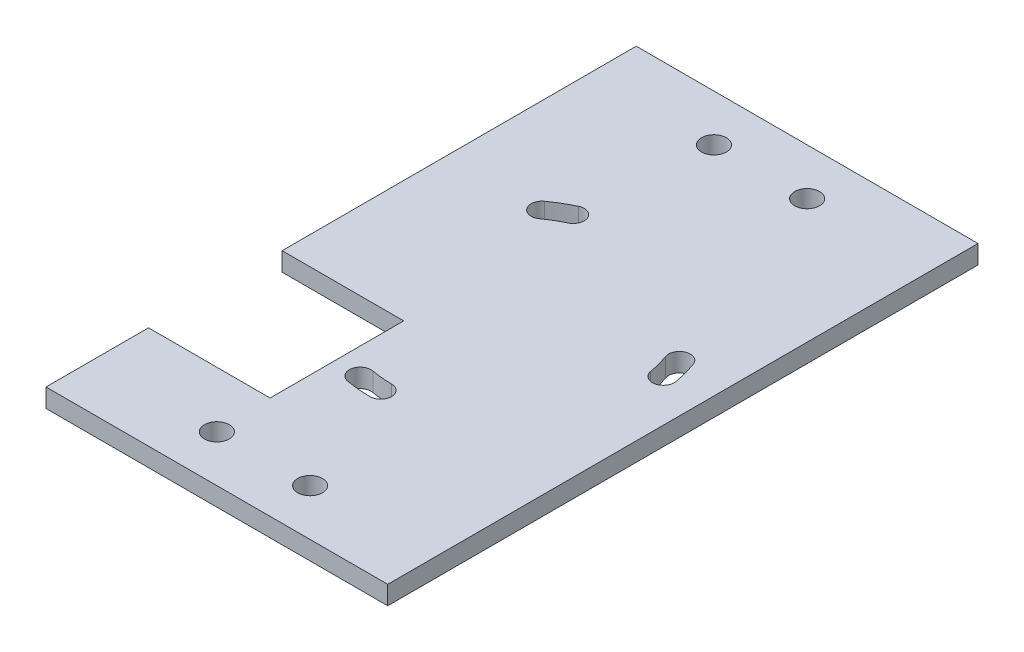
ISO-10303-21;
HEADER;
FILE_DESCRIPTION(('STEP AP214'),'2;1');
FILE_NAME('part.step','',(''),(''),'','','');
FILE_SCHEMA(('AUTOMOTIVE_DESIGN { 1 0 10303 214 1 1 1 1 }'));
ENDSEC;
DATA;
#1=APPLICATION_CONTEXT('core data for automotive mechanical design processes');
#2=APPLICATION_PROTOCOL_DEFINITION('international standard','automotive_design',2000,#1);
#3=PRODUCT_CONTEXT('',#1,'mechanical');
#4=PRODUCT('Part','Part','',(#3));
#5=PRODUCT_RELATED_PRODUCT_CATEGORY('part','',(#4));
#6=PRODUCT_DEFINITION_FORMATION('','',#4);
#7=PRODUCT_DEFINITION_CONTEXT('part definition',#1,'design');
#8=PRODUCT_DEFINITION('design','',#6,#7);
#9=PRODUCT_DEFINITION_SHAPE('','',#8);
#10=(LENGTH_UNIT() NAMED_UNIT(*) SI_UNIT(.MILLI.,.METRE.));
#11=(NAMED_UNIT(*) PLANE_ANGLE_UNIT() SI_UNIT($,.RADIAN.));
#12=(NAMED_UNIT(*) SI_UNIT($,.STERADIAN.) SOLID_ANGLE_UNIT());
#13=UNCERTAINTY_MEASURE_WITH_UNIT(LENGTH_MEASURE(1.E-05),#10,'distance_accuracy_value','');
#14=(GEOMETRIC_REPRESENTATION_CONTEXT(3) GLOBAL_UNCERTAINTY_ASSIGNED_CONTEXT((#13)) GLOBAL_UNIT_ASSIGNED_CONTEXT((#10,
#11,#12)) REPRESENTATION_CONTEXT('',''));
#15=CARTESIAN_POINT('',(0.,0.,0.));
#16=DIRECTION('',(0.,0.,1.));
#17=DIRECTION('',(1.,0.,0.));
#18=AXIS2_PLACEMENT_3D('',#15,#16,#17);
#19=CARTESIAN_POINT('',(54.9999999999997,163.5,285.));
#20=DIRECTION('',(0.,1.,0.));
#21=DIRECTION('',(0.,0.,1.));
#22=AXIS2_PLACEMENT_3D('',#19,#20,#21);
#23=PLANE('',#22);
#24=CARTESIAN_POINT('',(-14.9999999999996,163.5,270.));
#25=DIRECTION('',(0.,1.,0.));
#26=DIRECTION('',(0.,0.,1.));
#27=AXIS2_PLACEMENT_3D('',#24,#25,#26);
#28=CIRCLE('',#27,4.);
#29=CARTESIAN_POINT('',(-14.9999999999996,163.5,274.));
#30=VERTEX_POINT('',#29);
#31=EDGE_CURVE('E337',#30,#30,#28,.F.);
#32=ORIENTED_EDGE('',*,*,#31,.F.);
#33=EDGE_LOOP('',(#32));
#34=FACE_BOUND('',#33,.T.);
#35=CARTESIAN_POINT('',(14.9999999999996,163.5,270.));
#36=DIRECTION('',(0.,1.,0.));
#37=DIRECTION('',(0.,0.,1.));
#38=AXIS2_PLACEMENT_3D('',#35,#36,#37);
#39=CIRCLE('',#38,4.);
#40=CARTESIAN_POINT('',(14.9999999999996,163.5,274.));
#41=VERTEX_POINT('',#40);
#42=EDGE_CURVE('E343',#41,#41,#39,.F.);
#43=ORIENTED_EDGE('',*,*,#42,.F.);
#44=EDGE_LOOP('',(#43));
#45=FACE_BOUND('',#44,.T.);
#46=CARTESIAN_POINT('',(15.0000000000004,163.5,110.));
#47=DIRECTION('',(0.,1.,0.));
#48=DIRECTION('',(0.,0.,1.));
#49=AXIS2_PLACEMENT_3D('',#46,#47,#48);
#50=CIRCLE('',#49,4.);
#51=CARTESIAN_POINT('',(15.0000000000004,163.5,114.));
#52=VERTEX_POINT('',#51);
#53=EDGE_CURVE('E346',#52,#52,#50,.F.);
#54=ORIENTED_EDGE('',*,*,#53,.F.);
#55=EDGE_LOOP('',(#54));
#56=FACE_BOUND('',#55,.T.);
#57=CARTESIAN_POINT('',(-15.0000000000004,163.5,110.));
#58=DIRECTION('',(0.,1.,0.));
#59=DIRECTION('',(0.,0.,1.));
#60=AXIS2_PLACEMENT_3D('',#57,#58,#59);
#61=CIRCLE('',#60,4.);
#62=CARTESIAN_POINT('',(-15.0000000000004,163.5,114.));
#63=VERTEX_POINT('',#62);
#64=EDGE_CURVE('E349',#63,#63,#61,.F.);
#65=ORIENTED_EDGE('',*,*,#64,.F.);
#66=EDGE_LOOP('',(#65));
#67=FACE_BOUND('',#66,.T.);
#68=CARTESIAN_POINT('',(-7.49679931350594,163.5,231.373647797338));
#69=DIRECTION('',(0.,1.,0.));
#70=DIRECTION('',(0.,0.,1.));
#71=AXIS2_PLACEMENT_3D('',#68,#69,#70);
#72=CIRCLE('',#71,3.49999999999998);
#73=CARTESIAN_POINT('',(-8.12082887800866,163.5,234.817568107482));
#74=VERTEX_POINT('',#73);
#75=CARTESIAN_POINT('',(-6.87276974900324,163.5,227.929727487193));
#76=VERTEX_POINT('',#75);
#77=EDGE_CURVE('E253',#74,#76,#72,.F.);
#78=ORIENTED_EDGE('',*,*,#77,.F.);
#79=CARTESIAN_POINT('',(0.,163.5,190.));
#80=DIRECTION('',(0.,1.,0.));
#81=DIRECTION('',(0.,0.,1.));
#82=AXIS2_PLACEMENT_3D('',#79,#80,#81);
#83=CIRCLE('',#82,45.5473629613692);
#84=CARTESIAN_POINT('',(-0.214966210620846,163.5,235.546855679212));
#85=VERTEX_POINT('',#84);
#86=EDGE_CURVE('E261',#85,#74,#83,.F.);
#87=ORIENTED_EDGE('',*,*,#86,.F.);
#88=CARTESIAN_POINT('',(-0.198447543276456,163.5,232.04689466034));
#89=DIRECTION('',(0.,1.,0.));
#90=DIRECTION('',(0.,0.,1.));
#91=AXIS2_PLACEMENT_3D('',#88,#89,#90);
#92=CIRCLE('',#91,3.49999999999998);
#93=CARTESIAN_POINT('',(-0.181928875932069,163.5,228.546933641467));
#94=VERTEX_POINT('',#93);
#95=EDGE_CURVE('E258',#94,#85,#92,.F.);
#96=ORIENTED_EDGE('',*,*,#95,.F.);
#97=CARTESIAN_POINT('',(0.,163.5,190.));
#98=DIRECTION('',(0.,1.,0.));
#99=DIRECTION('',(0.,0.,1.));
#100=AXIS2_PLACEMENT_3D('',#97,#98,#99);
#101=CIRCLE('',#100,38.5473629613692);
#102=EDGE_CURVE('E255',#94,#76,#101,.F.);
#103=ORIENTED_EDGE('',*,*,#102,.T.);
#104=EDGE_LOOP('',(#78,#87,#96,#103));
#105=FACE_BOUND('',#104,.T.);
#106=CARTESIAN_POINT('',(41.4085690380747,163.5,182.698552046058));
#107=DIRECTION('',(0.,1.,0.));
#108=DIRECTION('',(0.,0.,1.));
#109=AXIS2_PLACEMENT_3D('',#106,#107,#108);
#110=CIRCLE('',#109,3.5);
#111=CARTESIAN_POINT('',(44.8553961736175,163.5,182.090783424224));
#112=VERTEX_POINT('',#111);
#113=CARTESIAN_POINT('',(37.961741902532,163.5,183.306320667893));
#114=VERTEX_POINT('',#113);
#115=EDGE_CURVE('E243',#112,#114,#110,.F.);
#116=ORIENTED_EDGE('',*,*,#115,.F.);
#117=CARTESIAN_POINT('',(0.,163.5,190.));
#118=DIRECTION('',(0.,1.,0.));
#119=DIRECTION('',(0.,0.,1.));
#120=AXIS2_PLACEMENT_3D('',#117,#118,#119);
#121=CIRCLE('',#120,45.5473629613692);
#122=CARTESIAN_POINT('',(42.8005208710561,163.5,174.421884391847));
#123=VERTEX_POINT('',#122);
#124=EDGE_CURVE('E246',#123,#112,#121,.F.);
#125=ORIENTED_EDGE('',*,*,#124,.F.);
#126=CARTESIAN_POINT('',(39.5115966983055,163.5,175.618954893486));
#127=DIRECTION('',(0.,1.,0.));
#128=DIRECTION('',(0.,0.,1.));
#129=AXIS2_PLACEMENT_3D('',#126,#127,#128);
#130=CIRCLE('',#129,3.50000000000001);
#131=CARTESIAN_POINT('',(36.2226725255548,163.5,176.816025395126));
#132=VERTEX_POINT('',#131);
#133=EDGE_CURVE('E248',#132,#123,#130,.F.);
#134=ORIENTED_EDGE('',*,*,#133,.F.);
#135=CARTESIAN_POINT('',(0.,163.5,190.));
#136=DIRECTION('',(0.,1.,0.));
#137=DIRECTION('',(0.,0.,1.));
#138=AXIS2_PLACEMENT_3D('',#135,#136,#137);
#139=CIRCLE('',#138,38.5473629613692);
#140=EDGE_CURVE('E250',#132,#114,#139,.F.);
#141=ORIENTED_EDGE('',*,*,#140,.T.);
#142=EDGE_LOOP('',(#116,#125,#134,#141));
#143=FACE_BOUND('',#142,.T.);
#144=CARTESIAN_POINT('',(-24.4983000477613,163.5,155.826705941994));
#145=DIRECTION('',(0.,1.,0.));
#146=DIRECTION('',(0.,0.,1.));
#147=AXIS2_PLACEMENT_3D('',#144,#145,#146);
#148=CIRCLE('',#147,3.50000000000002);
#149=CARTESIAN_POINT('',(-22.4590746569576,163.5,158.671272658649));
#150=VERTEX_POINT('',#149);
#151=CARTESIAN_POINT('',(-26.5375254385651,163.5,152.982139225339));
#152=VERTEX_POINT('',#151);
#153=EDGE_CURVE('E234',#150,#152,#148,.F.);
#154=ORIENTED_EDGE('',*,*,#153,.F.);
#155=CARTESIAN_POINT('',(0.,163.5,190.));
#156=DIRECTION('',(0.,1.,0.));
#157=DIRECTION('',(0.,0.,1.));
#158=AXIS2_PLACEMENT_3D('',#155,#156,#157);
#159=CIRCLE('',#158,38.5473629613692);
#160=CARTESIAN_POINT('',(-16.6776944362023,163.5,155.247249035965));
#161=VERTEX_POINT('',#160);
#162=EDGE_CURVE('E240',#150,#161,#159,.F.);
#163=ORIENTED_EDGE('',*,*,#162,.T.);
#164=CARTESIAN_POINT('',(-18.191985584606,163.5,152.091789906478));
#165=DIRECTION('',(0.,1.,0.));
#166=DIRECTION('',(0.,0.,1.));
#167=AXIS2_PLACEMENT_3D('',#164,#165,#166);
#168=CIRCLE('',#167,3.49999999999999);
#169=CARTESIAN_POINT('',(-19.7062767330098,163.5,148.93633077699));
#170=VERTEX_POINT('',#169);
#171=EDGE_CURVE('E238',#170,#161,#168,.F.);
#172=ORIENTED_EDGE('',*,*,#171,.F.);
#173=CARTESIAN_POINT('',(0.,163.5,190.));
#174=DIRECTION('',(0.,1.,0.));
#175=DIRECTION('',(0.,0.,1.));
#176=AXIS2_PLACEMENT_3D('',#173,#174,#175);
#177=CIRCLE('',#176,45.5473629613692);
#178=EDGE_CURVE('E236',#152,#170,#177,.F.);
#179=ORIENTED_EDGE('',*,*,#178,.F.);
#180=EDGE_LOOP('',(#154,#163,#172,#179));
#181=FACE_BOUND('',#180,.T.);
#182=DIRECTION('',(1.,0.,0.));
#183=VECTOR('',#182,1.);
#184=CARTESIAN_POINT('',(54.9999999999997,163.5,209.));
#185=LINE('',#184,#183);
#186=CARTESIAN_POINT('',(-54.9999999999997,163.5,209.));
#187=VERTEX_POINT('',#186);
#188=CARTESIAN_POINT('',(-15.8623207248155,163.5,209.));
#189=VERTEX_POINT('',#188);
#190=EDGE_CURVE('E330',#187,#189,#185,.T.);
#191=ORIENTED_EDGE('',*,*,#190,.F.);
#192=DIRECTION('',(0.,0.,-1.));
#193=VECTOR('',#192,1.);
#194=CARTESIAN_POINT('',(-55.0000000000003,163.5,285.));
#195=LINE('',#194,#193);
#196=CARTESIAN_POINT('',(-55.0000000000003,163.5,95.0000000000002));
#197=VERTEX_POINT('',#196);
#198=EDGE_CURVE('E195',#187,#197,#195,.T.);
#199=ORIENTED_EDGE('',*,*,#198,.T.);
#200=DIRECTION('',(-1.,0.,0.));
#201=VECTOR('',#200,1.);
#202=CARTESIAN_POINT('',(54.9999999999997,163.5,95.0000000000002));
#203=LINE('',#202,#201);
#204=CARTESIAN_POINT('',(54.9999999999997,163.5,95.0000000000002));
#205=VERTEX_POINT('',#204);
#206=EDGE_CURVE('E47',#205,#197,#203,.T.);
#207=ORIENTED_EDGE('',*,*,#206,.F.);
#208=DIRECTION('',(0.,0.,-1.));
#209=VECTOR('',#208,1.);
#210=CARTESIAN_POINT('',(54.9999999999997,163.5,285.));
#211=LINE('',#210,#209);
#212=CARTESIAN_POINT('',(54.9999999999997,163.5,285.));
#213=VERTEX_POINT('',#212);
#214=EDGE_CURVE('E207',#213,#205,#211,.T.);
#215=ORIENTED_EDGE('',*,*,#214,.F.);
#216=DIRECTION('',(-1.,0.,0.));
#217=VECTOR('',#216,1.);
#218=CARTESIAN_POINT('',(54.9999999999997,163.5,285.));
#219=LINE('',#218,#217);
#220=CARTESIAN_POINT('',(-55.0000000000003,163.5,285.));
#221=VERTEX_POINT('',#220);
#222=EDGE_CURVE('E11',#213,#221,#219,.T.);
#223=ORIENTED_EDGE('',*,*,#222,.T.);
#224=CARTESIAN_POINT('',(-55.0000000000003,163.5,252.));
#225=VERTEX_POINT('',#224);
#226=EDGE_CURVE('E227',#221,#225,#195,.T.);
#227=ORIENTED_EDGE('',*,*,#226,.T.);
#228=DIRECTION('',(-1.,0.,0.));
#229=VECTOR('',#228,1.);
#230=CARTESIAN_POINT('',(54.9999999999997,163.5,252.));
#231=LINE('',#230,#229);
#232=CARTESIAN_POINT('',(-15.8623207248155,163.5,252.));
#233=VERTEX_POINT('',#232);
#234=EDGE_CURVE('E54',#233,#225,#231,.T.);
#235=ORIENTED_EDGE('',*,*,#234,.F.);
#236=DIRECTION('',(0.,0.,1.));
#237=VECTOR('',#236,1.);
#238=CARTESIAN_POINT('',(-15.8623207248155,163.5,285.));
#239=LINE('',#238,#237);
#240=EDGE_CURVE('E273',#189,#233,#239,.T.);
#241=ORIENTED_EDGE('',*,*,#240,.F.);
#242=EDGE_LOOP('',(#191,#199,#207,#215,#223,#227,#235,#241));
#243=FACE_BOUND('',#242,.T.);
#244=ADVANCED_FACE('F39',(#34,#45,#56,#67,#105,#143,#181,#243),#23,.F.);
#245=CARTESIAN_POINT('',(54.9999999999997,169.5,285.));
#246=DIRECTION('',(0.,-1.,0.));
#247=DIRECTION('',(0.,0.,-1.));
#248=AXIS2_PLACEMENT_3D('',#245,#246,#247);
#249=PLANE('',#248);
#250=CARTESIAN_POINT('',(-14.9999999999996,169.5,270.));
#251=DIRECTION('',(0.,-1.,0.));
#252=DIRECTION('',(0.,0.,-1.));
#253=AXIS2_PLACEMENT_3D('',#250,#251,#252);
#254=CIRCLE('',#253,4.);
#255=CARTESIAN_POINT('',(-14.9999999999996,169.5,266.));
#256=VERTEX_POINT('',#255);
#257=EDGE_CURVE('E356',#256,#256,#254,.T.);
#258=ORIENTED_EDGE('',*,*,#257,.T.);
#259=EDGE_LOOP('',(#258));
#260=FACE_BOUND('',#259,.T.);
#261=CARTESIAN_POINT('',(14.9999999999996,169.5,270.));
#262=DIRECTION('',(0.,-1.,0.));
#263=DIRECTION('',(0.,0.,-1.));
#264=AXIS2_PLACEMENT_3D('',#261,#262,#263);
#265=CIRCLE('',#264,4.);
#266=CARTESIAN_POINT('',(14.9999999999996,169.5,266.));
#267=VERTEX_POINT('',#266);
#268=EDGE_CURVE('E359',#267,#267,#265,.T.);
#269=ORIENTED_EDGE('',*,*,#268,.T.);
#270=EDGE_LOOP('',(#269));
#271=FACE_BOUND('',#270,.T.);
#272=CARTESIAN_POINT('',(15.0000000000004,169.5,110.));
#273=DIRECTION('',(0.,-1.,0.));
#274=DIRECTION('',(0.,0.,-1.));
#275=AXIS2_PLACEMENT_3D('',#272,#273,#274);
#276=CIRCLE('',#275,4.);
#277=CARTESIAN_POINT('',(15.0000000000004,169.5,106.));
#278=VERTEX_POINT('',#277);
#279=EDGE_CURVE('E355',#278,#278,#276,.T.);
#280=ORIENTED_EDGE('',*,*,#279,.T.);
#281=EDGE_LOOP('',(#280));
#282=FACE_BOUND('',#281,.T.);
#283=CARTESIAN_POINT('',(-15.0000000000004,169.5,110.));
#284=DIRECTION('',(0.,-1.,0.));
#285=DIRECTION('',(0.,0.,-1.));
#286=AXIS2_PLACEMENT_3D('',#283,#284,#285);
#287=CIRCLE('',#286,4.);
#288=CARTESIAN_POINT('',(-15.0000000000004,169.5,106.));
#289=VERTEX_POINT('',#288);
#290=EDGE_CURVE('E352',#289,#289,#287,.T.);
#291=ORIENTED_EDGE('',*,*,#290,.T.);
#292=EDGE_LOOP('',(#291));
#293=FACE_BOUND('',#292,.T.);
#294=CARTESIAN_POINT('',(-7.49679931350594,169.5,231.373647797338));
#295=DIRECTION('',(0.,-1.,0.));
#296=DIRECTION('',(0.,0.,-1.));
#297=AXIS2_PLACEMENT_3D('',#294,#295,#296);
#298=CIRCLE('',#297,3.49999999999998);
#299=CARTESIAN_POINT('',(-8.12082887800866,169.5,234.817568107482));
#300=VERTEX_POINT('',#299);
#301=CARTESIAN_POINT('',(-6.87276974900324,169.5,227.929727487193));
#302=VERTEX_POINT('',#301);
#303=EDGE_CURVE('E266',#300,#302,#298,.T.);
#304=ORIENTED_EDGE('',*,*,#303,.T.);
#305=CARTESIAN_POINT('',(0.,169.5,190.));
#306=DIRECTION('',(0.,-1.,0.));
#307=DIRECTION('',(0.,0.,-1.));
#308=AXIS2_PLACEMENT_3D('',#305,#306,#307);
#309=CIRCLE('',#308,38.5473629613692);
#310=CARTESIAN_POINT('',(-0.181928875932069,169.5,228.546933641467));
#311=VERTEX_POINT('',#310);
#312=EDGE_CURVE('E264',#311,#302,#309,.T.);
#313=ORIENTED_EDGE('',*,*,#312,.F.);
#314=CARTESIAN_POINT('',(-0.198447543276456,169.5,232.04689466034));
#315=DIRECTION('',(0.,-1.,0.));
#316=DIRECTION('',(0.,0.,-1.));
#317=AXIS2_PLACEMENT_3D('',#314,#315,#316);
#318=CIRCLE('',#317,3.49999999999998);
#319=CARTESIAN_POINT('',(-0.214966210620846,169.5,235.546855679212));
#320=VERTEX_POINT('',#319);
#321=EDGE_CURVE('E267',#311,#320,#318,.T.);
#322=ORIENTED_EDGE('',*,*,#321,.T.);
#323=CARTESIAN_POINT('',(0.,169.5,190.));
#324=DIRECTION('',(0.,-1.,0.));
#325=DIRECTION('',(0.,0.,-1.));
#326=AXIS2_PLACEMENT_3D('',#323,#324,#325);
#327=CIRCLE('',#326,45.5473629613692);
#328=EDGE_CURVE('E270',#320,#300,#327,.T.);
#329=ORIENTED_EDGE('',*,*,#328,.T.);
#330=EDGE_LOOP('',(#304,#313,#322,#329));
#331=FACE_BOUND('',#330,.T.);
#332=CARTESIAN_POINT('',(41.4085690380747,169.5,182.698552046058));
#333=DIRECTION('',(0.,-1.,0.));
#334=DIRECTION('',(0.,0.,-1.));
#335=AXIS2_PLACEMENT_3D('',#332,#333,#334);
#336=CIRCLE('',#335,3.5);
#337=CARTESIAN_POINT('',(44.8553961736175,169.5,182.090783424224));
#338=VERTEX_POINT('',#337);
#339=CARTESIAN_POINT('',(37.961741902532,169.5,183.306320667893));
#340=VERTEX_POINT('',#339);
#341=EDGE_CURVE('E295',#338,#340,#336,.T.);
#342=ORIENTED_EDGE('',*,*,#341,.T.);
#343=CARTESIAN_POINT('',(0.,169.5,190.));
#344=DIRECTION('',(0.,-1.,0.));
#345=DIRECTION('',(0.,0.,-1.));
#346=AXIS2_PLACEMENT_3D('',#343,#344,#345);
#347=CIRCLE('',#346,38.5473629613692);
#348=CARTESIAN_POINT('',(36.2226725255548,169.5,176.816025395126));
#349=VERTEX_POINT('',#348);
#350=EDGE_CURVE('E277',#349,#340,#347,.T.);
#351=ORIENTED_EDGE('',*,*,#350,.F.);
#352=CARTESIAN_POINT('',(39.5115966983055,169.5,175.618954893486));
#353=DIRECTION('',(0.,-1.,0.));
#354=DIRECTION('',(0.,0.,-1.));
#355=AXIS2_PLACEMENT_3D('',#352,#353,#354);
#356=CIRCLE('',#355,3.50000000000001);
#357=CARTESIAN_POINT('',(42.8005208710561,169.5,174.421884391847));
#358=VERTEX_POINT('',#357);
#359=EDGE_CURVE('E288',#349,#358,#356,.T.);
#360=ORIENTED_EDGE('',*,*,#359,.T.);
#361=CARTESIAN_POINT('',(0.,169.5,190.));
#362=DIRECTION('',(0.,-1.,0.));
#363=DIRECTION('',(0.,0.,-1.));
#364=AXIS2_PLACEMENT_3D('',#361,#362,#363);
#365=CIRCLE('',#364,45.5473629613692);
#366=EDGE_CURVE('E292',#358,#338,#365,.T.);
#367=ORIENTED_EDGE('',*,*,#366,.T.);
#368=EDGE_LOOP('',(#342,#351,#360,#367));
#369=FACE_BOUND('',#368,.T.);
#370=CARTESIAN_POINT('',(-24.4983000477613,169.5,155.826705941994));
#371=DIRECTION('',(0.,-1.,0.));
#372=DIRECTION('',(0.,0.,-1.));
#373=AXIS2_PLACEMENT_3D('',#370,#371,#372);
#374=CIRCLE('',#373,3.50000000000002);
#375=CARTESIAN_POINT('',(-22.4590746569576,169.5,158.671272658649));
#376=VERTEX_POINT('',#375);
#377=CARTESIAN_POINT('',(-26.5375254385651,169.5,152.982139225339));
#378=VERTEX_POINT('',#377);
#379=EDGE_CURVE('E310',#376,#378,#374,.T.);
#380=ORIENTED_EDGE('',*,*,#379,.T.);
#381=CARTESIAN_POINT('',(0.,169.5,190.));
#382=DIRECTION('',(0.,-1.,0.));
#383=DIRECTION('',(0.,0.,-1.));
#384=AXIS2_PLACEMENT_3D('',#381,#382,#383);
#385=CIRCLE('',#384,45.5473629613692);
#386=CARTESIAN_POINT('',(-19.7062767330098,169.5,148.93633077699));
#387=VERTEX_POINT('',#386);
#388=EDGE_CURVE('E313',#378,#387,#385,.T.);
#389=ORIENTED_EDGE('',*,*,#388,.T.);
#390=CARTESIAN_POINT('',(-18.191985584606,169.5,152.091789906478));
#391=DIRECTION('',(0.,-1.,0.));
#392=DIRECTION('',(0.,0.,-1.));
#393=AXIS2_PLACEMENT_3D('',#390,#391,#392);
#394=CIRCLE('',#393,3.49999999999999);
#395=CARTESIAN_POINT('',(-16.6776944362023,169.5,155.247249035965));
#396=VERTEX_POINT('',#395);
#397=EDGE_CURVE('E324',#387,#396,#394,.T.);
#398=ORIENTED_EDGE('',*,*,#397,.T.);
#399=CARTESIAN_POINT('',(0.,169.5,190.));
#400=DIRECTION('',(0.,-1.,0.));
#401=DIRECTION('',(0.,0.,-1.));
#402=AXIS2_PLACEMENT_3D('',#399,#400,#401);
#403=CIRCLE('',#402,38.5473629613692);
#404=EDGE_CURVE('E263',#376,#396,#403,.T.);
#405=ORIENTED_EDGE('',*,*,#404,.F.);
#406=EDGE_LOOP('',(#380,#389,#398,#405));
#407=FACE_BOUND('',#406,.T.);
#408=DIRECTION('',(1.,0.,0.));
#409=VECTOR('',#408,1.);
#410=CARTESIAN_POINT('',(-54.9999999999997,169.5,209.));
#411=LINE('',#410,#409);
#412=CARTESIAN_POINT('',(-54.9999999999997,169.5,209.));
#413=VERTEX_POINT('',#412);
#414=CARTESIAN_POINT('',(-15.8623207248155,169.5,209.));
#415=VERTEX_POINT('',#414);
#416=EDGE_CURVE('E176',#413,#415,#411,.T.);
#417=ORIENTED_EDGE('',*,*,#416,.T.);
#418=DIRECTION('',(0.,0.,1.));
#419=VECTOR('',#418,1.);
#420=CARTESIAN_POINT('',(-15.8623207248155,169.5,209.));
#421=LINE('',#420,#419);
#422=CARTESIAN_POINT('',(-15.8623207248155,169.5,252.));
#423=VERTEX_POINT('',#422);
#424=EDGE_CURVE('E186',#415,#423,#421,.T.);
#425=ORIENTED_EDGE('',*,*,#424,.T.);
#426=DIRECTION('',(-1.,0.,0.));
#427=VECTOR('',#426,1.);
#428=CARTESIAN_POINT('',(-15.8623207248155,169.5,252.));
#429=LINE('',#428,#427);
#430=CARTESIAN_POINT('',(-54.9999999999997,169.5,252.));
#431=VERTEX_POINT('',#430);
#432=EDGE_CURVE('E333',#423,#431,#429,.T.);
#433=ORIENTED_EDGE('',*,*,#432,.T.);
#434=DIRECTION('',(0.,0.,1.));
#435=VECTOR('',#434,1.);
#436=CARTESIAN_POINT('',(-55.0000000000003,169.5,285.));
#437=LINE('',#436,#435);
#438=CARTESIAN_POINT('',(-55.0000000000003,169.5,285.));
#439=VERTEX_POINT('',#438);
#440=EDGE_CURVE('E204',#431,#439,#437,.T.);
#441=ORIENTED_EDGE('',*,*,#440,.T.);
#442=DIRECTION('',(-1.,0.,0.));
#443=VECTOR('',#442,1.);
#444=CARTESIAN_POINT('',(54.9999999999997,169.5,285.));
#445=LINE('',#444,#443);
#446=CARTESIAN_POINT('',(54.9999999999997,169.5,285.));
#447=VERTEX_POINT('',#446);
#448=EDGE_CURVE('E218',#447,#439,#445,.T.);
#449=ORIENTED_EDGE('',*,*,#448,.F.);
#450=DIRECTION('',(0.,0.,1.));
#451=VECTOR('',#450,1.);
#452=CARTESIAN_POINT('',(54.9999999999997,169.5,285.));
#453=LINE('',#452,#451);
#454=CARTESIAN_POINT('',(54.9999999999997,169.5,95.0000000000002));
#455=VERTEX_POINT('',#454);
#456=EDGE_CURVE('E216',#455,#447,#453,.T.);
#457=ORIENTED_EDGE('',*,*,#456,.F.);
#458=DIRECTION('',(-1.,0.,0.));
#459=VECTOR('',#458,1.);
#460=CARTESIAN_POINT('',(54.9999999999997,169.5,95.0000000000002));
#461=LINE('',#460,#459);
#462=CARTESIAN_POINT('',(-55.0000000000003,169.5,95.0000000000002));
#463=VERTEX_POINT('',#462);
#464=EDGE_CURVE('E201',#455,#463,#461,.T.);
#465=ORIENTED_EDGE('',*,*,#464,.T.);
#466=EDGE_CURVE('E194',#463,#413,#437,.T.);
#467=ORIENTED_EDGE('',*,*,#466,.T.);
#468=EDGE_LOOP('',(#417,#425,#433,#441,#449,#457,#465,#467));
#469=FACE_BOUND('',#468,.T.);
#470=ADVANCED_FACE('F198',(#260,#271,#282,#293,#331,#369,#407,#469),#249,.F.);
#471=CARTESIAN_POINT('',(-55.0000000000003,0.,0.));
#472=DIRECTION('',(1.,0.,0.));
#473=DIRECTION('',(0.,0.,-1.));
#474=AXIS2_PLACEMENT_3D('',#471,#472,#473);
#475=PLANE('',#474);
#476=DIRECTION('',(0.,-1.,0.));
#477=VECTOR('',#476,1.);
#478=CARTESIAN_POINT('',(-54.9999999999997,227.644285523576,209.));
#479=LINE('',#478,#477);
#480=EDGE_CURVE('E179',#413,#187,#479,.T.);
#481=ORIENTED_EDGE('',*,*,#480,.F.);
#482=ORIENTED_EDGE('',*,*,#466,.F.);
#483=DIRECTION('',(0.,1.,0.));
#484=VECTOR('',#483,1.);
#485=CARTESIAN_POINT('',(-55.0000000000003,169.5,95.0000000000002));
#486=LINE('',#485,#484);
#487=EDGE_CURVE('E209',#197,#463,#486,.T.);
#488=ORIENTED_EDGE('',*,*,#487,.F.);
#489=ORIENTED_EDGE('',*,*,#198,.F.);
#490=EDGE_LOOP('',(#481,#482,#488,#489));
#491=FACE_BOUND('',#490,.T.);
#492=ADVANCED_FACE('F192',(#491),#475,.F.);
#493=DIRECTION('',(0.,-1.,0.));
#494=VECTOR('',#493,1.);
#495=CARTESIAN_POINT('',(-54.9999999999997,227.644285523576,252.));
#496=LINE('',#495,#494);
#497=EDGE_CURVE('E196',#431,#225,#496,.T.);
#498=ORIENTED_EDGE('',*,*,#497,.T.);
#499=ORIENTED_EDGE('',*,*,#226,.F.);
#500=DIRECTION('',(0.,-1.,0.));
#501=VECTOR('',#500,1.);
#502=CARTESIAN_POINT('',(-55.0000000000003,169.5,285.));
#503=LINE('',#502,#501);
#504=EDGE_CURVE('E230',#439,#221,#503,.T.);
#505=ORIENTED_EDGE('',*,*,#504,.F.);
#506=ORIENTED_EDGE('',*,*,#440,.F.);
#507=EDGE_LOOP('',(#498,#499,#505,#506));
#508=FACE_BOUND('',#507,.T.);
#509=ADVANCED_FACE('F396',(#508),#475,.F.);
#510=CARTESIAN_POINT('',(54.9999999999997,169.5,285.));
#511=DIRECTION('',(0.,0.,-1.));
#512=DIRECTION('',(-1.,0.,0.));
#513=AXIS2_PLACEMENT_3D('',#510,#511,#512);
#514=PLANE('',#513);
#515=ORIENTED_EDGE('',*,*,#448,.T.);
#516=ORIENTED_EDGE('',*,*,#504,.T.);
#517=ORIENTED_EDGE('',*,*,#222,.F.);
#518=DIRECTION('',(0.,-1.,0.));
#519=VECTOR('',#518,1.);
#520=CARTESIAN_POINT('',(54.9999999999997,169.5,285.));
#521=LINE('',#520,#519);
#522=EDGE_CURVE('E203',#447,#213,#521,.T.);
#523=ORIENTED_EDGE('',*,*,#522,.F.);
#524=EDGE_LOOP('',(#515,#516,#517,#523));
#525=FACE_BOUND('',#524,.T.);
#526=ADVANCED_FACE('F41',(#525),#514,.F.);
#527=CARTESIAN_POINT('',(54.9999999999997,169.5,95.0000000000002));
#528=DIRECTION('',(0.,0.,1.));
#529=DIRECTION('',(1.,0.,0.));
#530=AXIS2_PLACEMENT_3D('',#527,#528,#529);
#531=PLANE('',#530);
#532=ORIENTED_EDGE('',*,*,#206,.T.);
#533=ORIENTED_EDGE('',*,*,#487,.T.);
#534=ORIENTED_EDGE('',*,*,#464,.F.);
#535=DIRECTION('',(0.,1.,0.));
#536=VECTOR('',#535,1.);
#537=CARTESIAN_POINT('',(54.9999999999997,169.5,95.0000000000002));
#538=LINE('',#537,#536);
#539=EDGE_CURVE('E214',#205,#455,#538,.T.);
#540=ORIENTED_EDGE('',*,*,#539,.F.);
#541=EDGE_LOOP('',(#532,#533,#534,#540));
#542=FACE_BOUND('',#541,.T.);
#543=ADVANCED_FACE('F225',(#542),#531,.F.);
#544=CARTESIAN_POINT('',(54.9999999999997,0.,0.));
#545=DIRECTION('',(1.,0.,0.));
#546=DIRECTION('',(0.,0.,-1.));
#547=AXIS2_PLACEMENT_3D('',#544,#545,#546);
#548=PLANE('',#547);
#549=ORIENTED_EDGE('',*,*,#522,.T.);
#550=ORIENTED_EDGE('',*,*,#214,.T.);
#551=ORIENTED_EDGE('',*,*,#539,.T.);
#552=ORIENTED_EDGE('',*,*,#456,.T.);
#553=EDGE_LOOP('',(#549,#550,#551,#552));
#554=FACE_BOUND('',#553,.T.);
#555=ADVANCED_FACE('F401',(#554),#548,.T.);
#556=CARTESIAN_POINT('',(-7.49679931350594,186.596678826075,231.373647797338));
#557=DIRECTION('',(0.,-1.,0.));
#558=DIRECTION('',(0.,0.,-1.));
#559=AXIS2_PLACEMENT_3D('',#556,#557,#558);
#560=CYLINDRICAL_SURFACE('',#559,3.49999999999998);
#561=ORIENTED_EDGE('',*,*,#77,.T.);
#562=DIRECTION('',(0.,-1.,0.));
#563=VECTOR('',#562,1.);
#564=CARTESIAN_POINT('',(-6.87276974900324,186.596678826075,227.929727487193));
#565=LINE('',#564,#563);
#566=EDGE_CURVE('E278',#302,#76,#565,.T.);
#567=ORIENTED_EDGE('',*,*,#566,.F.);
#568=ORIENTED_EDGE('',*,*,#303,.F.);
#569=DIRECTION('',(0.,-1.,0.));
#570=VECTOR('',#569,1.);
#571=CARTESIAN_POINT('',(-8.12082887800866,186.596678826075,234.817568107482));
#572=LINE('',#571,#570);
#573=EDGE_CURVE('E274',#300,#74,#572,.T.);
#574=ORIENTED_EDGE('',*,*,#573,.T.);
#575=EDGE_LOOP('',(#561,#567,#568,#574));
#576=FACE_BOUND('',#575,.T.);
#577=ADVANCED_FACE('F403',(#576),#560,.F.);
#578=CARTESIAN_POINT('',(0.,186.596678826075,190.));
#579=DIRECTION('',(0.,-1.,0.));
#580=DIRECTION('',(0.,0.,-1.));
#581=AXIS2_PLACEMENT_3D('',#578,#579,#580);
#582=CYLINDRICAL_SURFACE('',#581,38.5473629613692);
#583=DIRECTION('',(0.,-1.,0.));
#584=VECTOR('',#583,1.);
#585=CARTESIAN_POINT('',(-0.181928875932069,186.596678826075,228.546933641467));
#586=LINE('',#585,#584);
#587=EDGE_CURVE('E281',#311,#94,#586,.T.);
#588=ORIENTED_EDGE('',*,*,#587,.F.);
#589=ORIENTED_EDGE('',*,*,#312,.T.);
#590=ORIENTED_EDGE('',*,*,#566,.T.);
#591=ORIENTED_EDGE('',*,*,#102,.F.);
#592=EDGE_LOOP('',(#588,#589,#590,#591));
#593=FACE_BOUND('',#592,.T.);
#594=ADVANCED_FACE('F409',(#593),#582,.T.);
#595=CARTESIAN_POINT('',(-0.198447543276456,186.596678826075,232.04689466034));
#596=DIRECTION('',(0.,-1.,0.));
#597=DIRECTION('',(0.,0.,-1.));
#598=AXIS2_PLACEMENT_3D('',#595,#596,#597);
#599=CYLINDRICAL_SURFACE('',#598,3.49999999999998);
#600=ORIENTED_EDGE('',*,*,#95,.T.);
#601=DIRECTION('',(0.,-1.,0.));
#602=VECTOR('',#601,1.);
#603=CARTESIAN_POINT('',(-0.214966210620846,186.596678826075,235.546855679212));
#604=LINE('',#603,#602);
#605=EDGE_CURVE('E284',#320,#85,#604,.T.);
#606=ORIENTED_EDGE('',*,*,#605,.F.);
#607=ORIENTED_EDGE('',*,*,#321,.F.);
#608=ORIENTED_EDGE('',*,*,#587,.T.);
#609=EDGE_LOOP('',(#600,#606,#607,#608));
#610=FACE_BOUND('',#609,.T.);
#611=ADVANCED_FACE('F480',(#610),#599,.F.);
#612=CARTESIAN_POINT('',(0.,186.596678826075,190.));
#613=DIRECTION('',(0.,-1.,0.));
#614=DIRECTION('',(0.,0.,-1.));
#615=AXIS2_PLACEMENT_3D('',#612,#613,#614);
#616=CYLINDRICAL_SURFACE('',#615,45.5473629613692);
#617=ORIENTED_EDGE('',*,*,#86,.T.);
#618=ORIENTED_EDGE('',*,*,#573,.F.);
#619=ORIENTED_EDGE('',*,*,#328,.F.);
#620=ORIENTED_EDGE('',*,*,#605,.T.);
#621=EDGE_LOOP('',(#617,#618,#619,#620));
#622=FACE_BOUND('',#621,.T.);
#623=ADVANCED_FACE('F466',(#622),#616,.F.);
#624=CARTESIAN_POINT('',(41.4085690380747,186.596678826075,182.698552046058));
#625=DIRECTION('',(0.,-1.,0.));
#626=DIRECTION('',(0.,0.,-1.));
#627=AXIS2_PLACEMENT_3D('',#624,#625,#626);
#628=CYLINDRICAL_SURFACE('',#627,3.5);
#629=ORIENTED_EDGE('',*,*,#115,.T.);
#630=DIRECTION('',(0.,-1.,0.));
#631=VECTOR('',#630,1.);
#632=CARTESIAN_POINT('',(37.961741902532,186.596678826075,183.306320667893));
#633=LINE('',#632,#631);
#634=EDGE_CURVE('E298',#340,#114,#633,.T.);
#635=ORIENTED_EDGE('',*,*,#634,.F.);
#636=ORIENTED_EDGE('',*,*,#341,.F.);
#637=DIRECTION('',(0.,-1.,0.));
#638=VECTOR('',#637,1.);
#639=CARTESIAN_POINT('',(44.8553961736175,186.596678826075,182.090783424224));
#640=LINE('',#639,#638);
#641=EDGE_CURVE('E291',#338,#112,#640,.T.);
#642=ORIENTED_EDGE('',*,*,#641,.T.);
#643=EDGE_LOOP('',(#629,#635,#636,#642));
#644=FACE_BOUND('',#643,.T.);
#645=ADVANCED_FACE('F462',(#644),#628,.F.);
#646=CARTESIAN_POINT('',(0.,186.596678826075,190.));
#647=DIRECTION('',(0.,-1.,0.));
#648=DIRECTION('',(0.,0.,-1.));
#649=AXIS2_PLACEMENT_3D('',#646,#647,#648);
#650=CYLINDRICAL_SURFACE('',#649,45.5473629613692);
#651=ORIENTED_EDGE('',*,*,#124,.T.);
#652=ORIENTED_EDGE('',*,*,#641,.F.);
#653=ORIENTED_EDGE('',*,*,#366,.F.);
#654=DIRECTION('',(0.,-1.,0.));
#655=VECTOR('',#654,1.);
#656=CARTESIAN_POINT('',(42.8005208710561,186.596678826075,174.421884391847));
#657=LINE('',#656,#655);
#658=EDGE_CURVE('E304',#358,#123,#657,.T.);
#659=ORIENTED_EDGE('',*,*,#658,.T.);
#660=EDGE_LOOP('',(#651,#652,#653,#659));
#661=FACE_BOUND('',#660,.T.);
#662=ADVANCED_FACE('F465',(#661),#650,.F.);
#663=CARTESIAN_POINT('',(39.5115966983055,186.596678826075,175.618954893486));
#664=DIRECTION('',(0.,-1.,0.));
#665=DIRECTION('',(0.,0.,-1.));
#666=AXIS2_PLACEMENT_3D('',#663,#664,#665);
#667=CYLINDRICAL_SURFACE('',#666,3.50000000000001);
#668=ORIENTED_EDGE('',*,*,#133,.T.);
#669=ORIENTED_EDGE('',*,*,#658,.F.);
#670=ORIENTED_EDGE('',*,*,#359,.F.);
#671=DIRECTION('',(0.,-1.,0.));
#672=VECTOR('',#671,1.);
#673=CARTESIAN_POINT('',(36.2226725255548,186.596678826075,176.816025395126));
#674=LINE('',#673,#672);
#675=EDGE_CURVE('E301',#349,#132,#674,.T.);
#676=ORIENTED_EDGE('',*,*,#675,.T.);
#677=EDGE_LOOP('',(#668,#669,#670,#676));
#678=FACE_BOUND('',#677,.T.);
#679=ADVANCED_FACE('F470',(#678),#667,.F.);
#680=CARTESIAN_POINT('',(0.,186.596678826075,190.));
#681=DIRECTION('',(0.,-1.,0.));
#682=DIRECTION('',(0.,0.,-1.));
#683=AXIS2_PLACEMENT_3D('',#680,#681,#682);
#684=CYLINDRICAL_SURFACE('',#683,38.5473629613692);
#685=ORIENTED_EDGE('',*,*,#675,.F.);
#686=ORIENTED_EDGE('',*,*,#350,.T.);
#687=ORIENTED_EDGE('',*,*,#634,.T.);
#688=ORIENTED_EDGE('',*,*,#140,.F.);
#689=EDGE_LOOP('',(#685,#686,#687,#688));
#690=FACE_BOUND('',#689,.T.);
#691=ADVANCED_FACE('F458',(#690),#684,.T.);
#692=CARTESIAN_POINT('',(-24.4983000477613,186.596678826075,155.826705941994));
#693=DIRECTION('',(0.,-1.,0.));
#694=DIRECTION('',(0.,0.,-1.));
#695=AXIS2_PLACEMENT_3D('',#692,#693,#694);
#696=CYLINDRICAL_SURFACE('',#695,3.50000000000002);
#697=ORIENTED_EDGE('',*,*,#153,.T.);
#698=DIRECTION('',(0.,-1.,0.));
#699=VECTOR('',#698,1.);
#700=CARTESIAN_POINT('',(-26.5375254385651,186.596678826075,152.982139225339));
#701=LINE('',#700,#699);
#702=EDGE_CURVE('E316',#378,#152,#701,.T.);
#703=ORIENTED_EDGE('',*,*,#702,.F.);
#704=ORIENTED_EDGE('',*,*,#379,.F.);
#705=DIRECTION('',(0.,-1.,0.));
#706=VECTOR('',#705,1.);
#707=CARTESIAN_POINT('',(-22.4590746569576,186.596678826075,158.671272658649));
#708=LINE('',#707,#706);
#709=EDGE_CURVE('E300',#376,#150,#708,.T.);
#710=ORIENTED_EDGE('',*,*,#709,.T.);
#711=EDGE_LOOP('',(#697,#703,#704,#710));
#712=FACE_BOUND('',#711,.T.);
#713=ADVANCED_FACE('F454',(#712),#696,.F.);
#714=CARTESIAN_POINT('',(0.,186.596678826075,190.));
#715=DIRECTION('',(0.,-1.,0.));
#716=DIRECTION('',(0.,0.,-1.));
#717=AXIS2_PLACEMENT_3D('',#714,#715,#716);
#718=CYLINDRICAL_SURFACE('',#717,45.5473629613692);
#719=ORIENTED_EDGE('',*,*,#178,.T.);
#720=DIRECTION('',(0.,-1.,0.));
#721=VECTOR('',#720,1.);
#722=CARTESIAN_POINT('',(-19.7062767330098,186.596678826075,148.93633077699));
#723=LINE('',#722,#721);
#724=EDGE_CURVE('E319',#387,#170,#723,.T.);
#725=ORIENTED_EDGE('',*,*,#724,.F.);
#726=ORIENTED_EDGE('',*,*,#388,.F.);
#727=ORIENTED_EDGE('',*,*,#702,.T.);
#728=EDGE_LOOP('',(#719,#725,#726,#727));
#729=FACE_BOUND('',#728,.T.);
#730=ADVANCED_FACE('F450',(#729),#718,.F.);
#731=CARTESIAN_POINT('',(-18.191985584606,186.596678826075,152.091789906478));
#732=DIRECTION('',(0.,-1.,0.));
#733=DIRECTION('',(0.,0.,-1.));
#734=AXIS2_PLACEMENT_3D('',#731,#732,#733);
#735=CYLINDRICAL_SURFACE('',#734,3.49999999999999);
#736=ORIENTED_EDGE('',*,*,#171,.T.);
#737=DIRECTION('',(0.,-1.,0.));
#738=VECTOR('',#737,1.);
#739=CARTESIAN_POINT('',(-16.6776944362023,186.596678826075,155.247249035965));
#740=LINE('',#739,#738);
#741=EDGE_CURVE('E62',#396,#161,#740,.T.);
#742=ORIENTED_EDGE('',*,*,#741,.F.);
#743=ORIENTED_EDGE('',*,*,#397,.F.);
#744=ORIENTED_EDGE('',*,*,#724,.T.);
#745=EDGE_LOOP('',(#736,#742,#743,#744));
#746=FACE_BOUND('',#745,.T.);
#747=ADVANCED_FACE('F447',(#746),#735,.F.);
#748=CARTESIAN_POINT('',(0.,186.596678826075,190.));
#749=DIRECTION('',(0.,-1.,0.));
#750=DIRECTION('',(0.,0.,-1.));
#751=AXIS2_PLACEMENT_3D('',#748,#749,#750);
#752=CYLINDRICAL_SURFACE('',#751,38.5473629613692);
#753=ORIENTED_EDGE('',*,*,#709,.F.);
#754=ORIENTED_EDGE('',*,*,#404,.T.);
#755=ORIENTED_EDGE('',*,*,#741,.T.);
#756=ORIENTED_EDGE('',*,*,#162,.F.);
#757=EDGE_LOOP('',(#753,#754,#755,#756));
#758=FACE_BOUND('',#757,.T.);
#759=ADVANCED_FACE('F444',(#758),#752,.T.);
#760=CARTESIAN_POINT('',(-15.8623207248155,227.644285523576,209.));
#761=DIRECTION('',(-1.,0.,0.));
#762=DIRECTION('',(0.,0.,1.));
#763=AXIS2_PLACEMENT_3D('',#760,#761,#762);
#764=PLANE('',#763);
#765=ORIENTED_EDGE('',*,*,#240,.T.);
#766=DIRECTION('',(0.,-1.,0.));
#767=VECTOR('',#766,1.);
#768=CARTESIAN_POINT('',(-15.8623207248155,227.644285523576,252.));
#769=LINE('',#768,#767);
#770=EDGE_CURVE('E187',#423,#233,#769,.T.);
#771=ORIENTED_EDGE('',*,*,#770,.F.);
#772=ORIENTED_EDGE('',*,*,#424,.F.);
#773=DIRECTION('',(0.,-1.,0.));
#774=VECTOR('',#773,1.);
#775=CARTESIAN_POINT('',(-15.8623207248155,227.644285523576,209.));
#776=LINE('',#775,#774);
#777=EDGE_CURVE('E182',#415,#189,#776,.T.);
#778=ORIENTED_EDGE('',*,*,#777,.T.);
#779=EDGE_LOOP('',(#765,#771,#772,#778));
#780=FACE_BOUND('',#779,.T.);
#781=ADVANCED_FACE('F390',(#780),#764,.T.);
#782=CARTESIAN_POINT('',(-54.9999999999997,227.644285523576,209.));
#783=DIRECTION('',(0.,0.,1.));
#784=DIRECTION('',(1.,0.,0.));
#785=AXIS2_PLACEMENT_3D('',#782,#783,#784);
#786=PLANE('',#785);
#787=ORIENTED_EDGE('',*,*,#190,.T.);
#788=ORIENTED_EDGE('',*,*,#777,.F.);
#789=ORIENTED_EDGE('',*,*,#416,.F.);
#790=ORIENTED_EDGE('',*,*,#480,.T.);
#791=EDGE_LOOP('',(#787,#788,#789,#790));
#792=FACE_BOUND('',#791,.T.);
#793=ADVANCED_FACE('F178',(#792),#786,.T.);
#794=CARTESIAN_POINT('',(-15.8623207248155,227.644285523576,252.));
#795=DIRECTION('',(0.,0.,-1.));
#796=DIRECTION('',(-1.,0.,0.));
#797=AXIS2_PLACEMENT_3D('',#794,#795,#796);
#798=PLANE('',#797);
#799=ORIENTED_EDGE('',*,*,#234,.T.);
#800=ORIENTED_EDGE('',*,*,#497,.F.);
#801=ORIENTED_EDGE('',*,*,#432,.F.);
#802=ORIENTED_EDGE('',*,*,#770,.T.);
#803=EDGE_LOOP('',(#799,#800,#801,#802));
#804=FACE_BOUND('',#803,.T.);
#805=ADVANCED_FACE('F438',(#804),#798,.T.);
#806=CARTESIAN_POINT('',(-15.0000000000004,180.813708498985,110.));
#807=DIRECTION('',(0.,-1.,0.));
#808=DIRECTION('',(0.,0.,-1.));
#809=AXIS2_PLACEMENT_3D('',#806,#807,#808);
#810=CYLINDRICAL_SURFACE('',#809,4.);
#811=ORIENTED_EDGE('',*,*,#290,.F.);
#812=EDGE_LOOP('',(#811));
#813=FACE_BOUND('',#812,.T.);
#814=ORIENTED_EDGE('',*,*,#64,.T.);
#815=EDGE_LOOP('',(#814));
#816=FACE_BOUND('',#815,.T.);
#817=ADVANCED_FACE('F371',(#813,#816),#810,.F.);
#818=CARTESIAN_POINT('',(15.0000000000004,180.813708498985,110.));
#819=DIRECTION('',(0.,-1.,0.));
#820=DIRECTION('',(0.,0.,-1.));
#821=AXIS2_PLACEMENT_3D('',#818,#819,#820);
#822=CYLINDRICAL_SURFACE('',#821,4.);
#823=ORIENTED_EDGE('',*,*,#279,.F.);
#824=EDGE_LOOP('',(#823));
#825=FACE_BOUND('',#824,.T.);
#826=ORIENTED_EDGE('',*,*,#53,.T.);
#827=EDGE_LOOP('',(#826));
#828=FACE_BOUND('',#827,.T.);
#829=ADVANCED_FACE('F367',(#825,#828),#822,.F.);
#830=CARTESIAN_POINT('',(14.9999999999996,180.813708498985,270.));
#831=DIRECTION('',(0.,-1.,0.));
#832=DIRECTION('',(0.,0.,-1.));
#833=AXIS2_PLACEMENT_3D('',#830,#831,#832);
#834=CYLINDRICAL_SURFACE('',#833,4.);
#835=ORIENTED_EDGE('',*,*,#268,.F.);
#836=EDGE_LOOP('',(#835));
#837=FACE_BOUND('',#836,.T.);
#838=ORIENTED_EDGE('',*,*,#42,.T.);
#839=EDGE_LOOP('',(#838));
#840=FACE_BOUND('',#839,.T.);
#841=ADVANCED_FACE('F370',(#837,#840),#834,.F.);
#842=CARTESIAN_POINT('',(-14.9999999999996,180.813708498985,270.));
#843=DIRECTION('',(0.,-1.,0.));
#844=DIRECTION('',(0.,0.,-1.));
#845=AXIS2_PLACEMENT_3D('',#842,#843,#844);
#846=CYLINDRICAL_SURFACE('',#845,4.);
#847=ORIENTED_EDGE('',*,*,#257,.F.);
#848=EDGE_LOOP('',(#847));
#849=FACE_BOUND('',#848,.T.);
#850=ORIENTED_EDGE('',*,*,#31,.T.);
#851=EDGE_LOOP('',(#850));
#852=FACE_BOUND('',#851,.T.);
#853=ADVANCED_FACE('F427',(#849,#852),#846,.F.);
#854=CLOSED_SHELL('',(#244,#470,#492,#509,#526,#543,#555,#577,#594,#611,#623,#645,#662,#679,
#691,#713,#730,#747,#759,#781,#793,#805,#817,#829,#841,#853));
#855=MANIFOLD_SOLID_BREP('B2',#854);
#856=ADVANCED_BREP_SHAPE_REPRESENTATION('',(#18,#855),#14);
#857=SHAPE_DEFINITION_REPRESENTATION(#9,#856);
ENDSEC;
END-ISO-10303-21;
